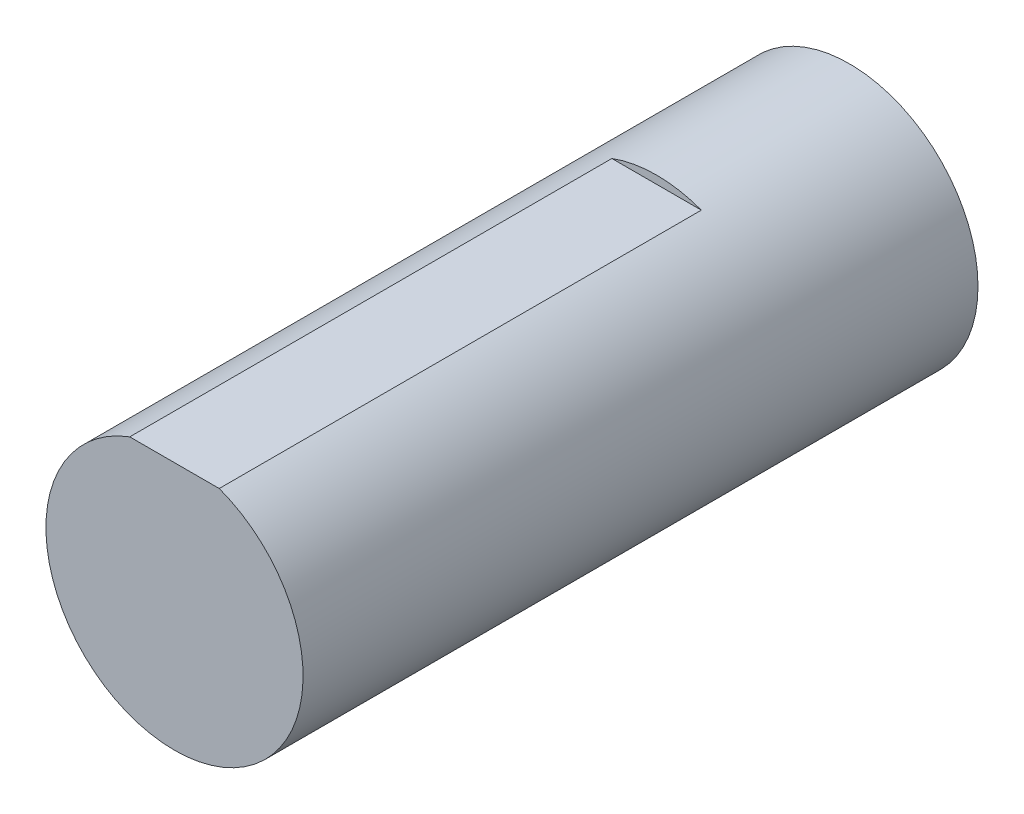
ISO-10303-21;
HEADER;
FILE_DESCRIPTION(('STEP AP214'),'2;1');
FILE_NAME('part.step','',(''),(''),'','','');
FILE_SCHEMA(('AUTOMOTIVE_DESIGN { 1 0 10303 214 1 1 1 1 }'));
ENDSEC;
DATA;
#1=APPLICATION_CONTEXT('core data for automotive mechanical design processes');
#2=APPLICATION_PROTOCOL_DEFINITION('international standard','automotive_design',2000,#1);
#3=PRODUCT_CONTEXT('',#1,'mechanical');
#4=PRODUCT('Part','Part','',(#3));
#5=PRODUCT_RELATED_PRODUCT_CATEGORY('part','',(#4));
#6=PRODUCT_DEFINITION_FORMATION('','',#4);
#7=PRODUCT_DEFINITION_CONTEXT('part definition',#1,'design');
#8=PRODUCT_DEFINITION('design','',#6,#7);
#9=PRODUCT_DEFINITION_SHAPE('','',#8);
#10=(LENGTH_UNIT() NAMED_UNIT(*) SI_UNIT(.MILLI.,.METRE.));
#11=(NAMED_UNIT(*) PLANE_ANGLE_UNIT() SI_UNIT($,.RADIAN.));
#12=(NAMED_UNIT(*) SI_UNIT($,.STERADIAN.) SOLID_ANGLE_UNIT());
#13=UNCERTAINTY_MEASURE_WITH_UNIT(LENGTH_MEASURE(1.E-05),#10,'distance_accuracy_value','');
#14=(GEOMETRIC_REPRESENTATION_CONTEXT(3) GLOBAL_UNCERTAINTY_ASSIGNED_CONTEXT((#13)) GLOBAL_UNIT_ASSIGNED_CONTEXT((#10,
#11,#12)) REPRESENTATION_CONTEXT('',''));
#15=CARTESIAN_POINT('',(0.,0.,0.));
#16=DIRECTION('',(0.,0.,1.));
#17=DIRECTION('',(1.,0.,0.));
#18=AXIS2_PLACEMENT_3D('',#15,#16,#17);
#19=CARTESIAN_POINT('',(0.,0.,21.));
#20=DIRECTION('',(0.,0.,-1.));
#21=DIRECTION('',(-1.,0.,0.));
#22=AXIS2_PLACEMENT_3D('',#19,#20,#21);
#23=CYLINDRICAL_SURFACE('',#22,4.);
#24=CARTESIAN_POINT('',(0.,0.,0.));
#25=DIRECTION('',(0.,0.,1.));
#26=DIRECTION('',(1.,0.,0.));
#27=AXIS2_PLACEMENT_3D('',#24,#25,#26);
#28=CIRCLE('',#27,4.);
#29=CARTESIAN_POINT('',(4.,0.,0.));
#30=VERTEX_POINT('',#29);
#31=EDGE_CURVE('E44',#30,#30,#28,.T.);
#32=ORIENTED_EDGE('',*,*,#31,.T.);
#33=EDGE_LOOP('',(#32));
#34=FACE_BOUND('',#33,.T.);
#35=DIRECTION('',(0.,0.,-1.));
#36=VECTOR('',#35,1.);
#37=CARTESIAN_POINT('',(1.39194109070751,3.75,50.8171511046914));
#38=LINE('',#37,#36);
#39=CARTESIAN_POINT('',(1.39194109070751,3.75,21.));
#40=VERTEX_POINT('',#39);
#41=CARTESIAN_POINT('',(1.39194109070751,3.75,6.00000000000001));
#42=VERTEX_POINT('',#41);
#43=EDGE_CURVE('E71',#40,#42,#38,.T.);
#44=ORIENTED_EDGE('',*,*,#43,.F.);
#45=CARTESIAN_POINT('',(0.,0.,21.));
#46=DIRECTION('',(0.,0.,1.));
#47=DIRECTION('',(1.,0.,0.));
#48=AXIS2_PLACEMENT_3D('',#45,#46,#47);
#49=CIRCLE('',#48,4.);
#50=CARTESIAN_POINT('',(-1.39194109070751,3.75,21.));
#51=VERTEX_POINT('',#50);
#52=EDGE_CURVE('E11',#51,#40,#49,.T.);
#53=ORIENTED_EDGE('',*,*,#52,.F.);
#54=DIRECTION('',(0.,0.,-1.));
#55=VECTOR('',#54,1.);
#56=CARTESIAN_POINT('',(-1.39194109070751,3.75,50.8171511046914));
#57=LINE('',#56,#55);
#58=CARTESIAN_POINT('',(-1.39194109070751,3.75,6.00000000000001));
#59=VERTEX_POINT('',#58);
#60=EDGE_CURVE('E55',#51,#59,#57,.T.);
#61=ORIENTED_EDGE('',*,*,#60,.T.);
#62=CARTESIAN_POINT('',(0.,0.,6.));
#63=DIRECTION('',(0.,0.,1.));
#64=DIRECTION('',(1.,0.,0.));
#65=AXIS2_PLACEMENT_3D('',#62,#63,#64);
#66=CIRCLE('',#65,4.);
#67=EDGE_CURVE('E70',#42,#59,#66,.T.);
#68=ORIENTED_EDGE('',*,*,#67,.F.);
#69=EDGE_LOOP('',(#44,#53,#61,#68));
#70=FACE_BOUND('',#69,.T.);
#71=ADVANCED_FACE('F41',(#34,#70),#23,.T.);
#72=CARTESIAN_POINT('',(0.,0.,21.));
#73=DIRECTION('',(0.,0.,1.));
#74=DIRECTION('',(1.,0.,0.));
#75=AXIS2_PLACEMENT_3D('',#72,#73,#74);
#76=PLANE('',#75);
#77=ORIENTED_EDGE('',*,*,#52,.T.);
#78=DIRECTION('',(1.,0.,0.));
#79=VECTOR('',#78,1.);
#80=CARTESIAN_POINT('',(-1.39194109070751,3.75,21.));
#81=LINE('',#80,#79);
#82=EDGE_CURVE('E59',#51,#40,#81,.T.);
#83=ORIENTED_EDGE('',*,*,#82,.F.);
#84=EDGE_LOOP('',(#77,#83));
#85=FACE_BOUND('',#84,.T.);
#86=ADVANCED_FACE('F86',(#85),#76,.T.);
#87=CARTESIAN_POINT('',(0.,0.,0.));
#88=DIRECTION('',(0.,0.,1.));
#89=DIRECTION('',(1.,0.,0.));
#90=AXIS2_PLACEMENT_3D('',#87,#88,#89);
#91=PLANE('',#90);
#92=ORIENTED_EDGE('',*,*,#31,.F.);
#93=EDGE_LOOP('',(#92));
#94=FACE_BOUND('',#93,.T.);
#95=ADVANCED_FACE('F84',(#94),#91,.F.);
#96=CARTESIAN_POINT('',(-1.39194109070751,3.75,50.8171511046914));
#97=DIRECTION('',(0.,1.,0.));
#98=DIRECTION('',(0.,0.,1.));
#99=AXIS2_PLACEMENT_3D('',#96,#97,#98);
#100=PLANE('',#99);
#101=ORIENTED_EDGE('',*,*,#60,.F.);
#102=ORIENTED_EDGE('',*,*,#82,.T.);
#103=ORIENTED_EDGE('',*,*,#43,.T.);
#104=DIRECTION('',(1.,0.,0.));
#105=VECTOR('',#104,1.);
#106=CARTESIAN_POINT('',(-1.39194109070751,3.75,6.00000000000001));
#107=LINE('',#106,#105);
#108=EDGE_CURVE('E67',#59,#42,#107,.T.);
#109=ORIENTED_EDGE('',*,*,#108,.F.);
#110=EDGE_LOOP('',(#101,#102,#103,#109));
#111=FACE_BOUND('',#110,.T.);
#112=ADVANCED_FACE('F73',(#111),#100,.T.);
#113=CARTESIAN_POINT('',(0.,0.,6.));
#114=DIRECTION('',(0.,0.,1.));
#115=DIRECTION('',(1.,0.,0.));
#116=AXIS2_PLACEMENT_3D('',#113,#114,#115);
#117=PLANE('',#116);
#118=ORIENTED_EDGE('',*,*,#108,.T.);
#119=ORIENTED_EDGE('',*,*,#67,.T.);
#120=EDGE_LOOP('',(#118,#119));
#121=FACE_BOUND('',#120,.T.);
#122=ADVANCED_FACE('F68',(#121),#117,.T.);
#123=CLOSED_SHELL('',(#71,#86,#95,#112,#122));
#124=MANIFOLD_SOLID_BREP('B2',#123);
#125=ADVANCED_BREP_SHAPE_REPRESENTATION('',(#18,#124),#14);
#126=SHAPE_DEFINITION_REPRESENTATION(#9,#125);
ENDSEC;
END-ISO-10303-21;
